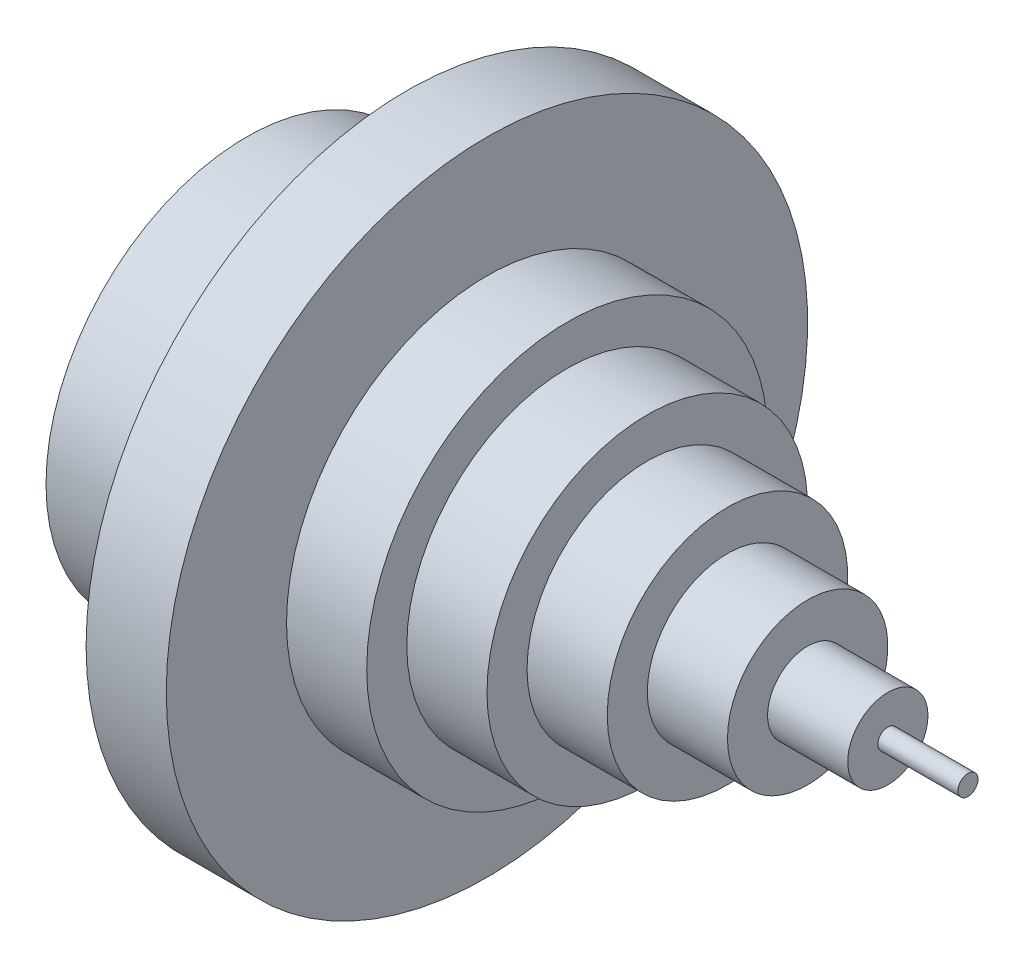
ISO-10303-21;
HEADER;
FILE_DESCRIPTION(('STEP AP214'),'2;1');
FILE_NAME('part.step','',(''),(''),'','','');
FILE_SCHEMA(('AUTOMOTIVE_DESIGN { 1 0 10303 214 1 1 1 1 }'));
ENDSEC;
DATA;
#1=APPLICATION_CONTEXT('core data for automotive mechanical design processes');
#2=APPLICATION_PROTOCOL_DEFINITION('international standard','automotive_design',2000,#1);
#3=PRODUCT_CONTEXT('',#1,'mechanical');
#4=PRODUCT('Part','Part','',(#3));
#5=PRODUCT_RELATED_PRODUCT_CATEGORY('part','',(#4));
#6=PRODUCT_DEFINITION_FORMATION('','',#4);
#7=PRODUCT_DEFINITION_CONTEXT('part definition',#1,'design');
#8=PRODUCT_DEFINITION('design','',#6,#7);
#9=PRODUCT_DEFINITION_SHAPE('','',#8);
#10=(LENGTH_UNIT() NAMED_UNIT(*) SI_UNIT(.MILLI.,.METRE.));
#11=(NAMED_UNIT(*) PLANE_ANGLE_UNIT() SI_UNIT($,.RADIAN.));
#12=(NAMED_UNIT(*) SI_UNIT($,.STERADIAN.) SOLID_ANGLE_UNIT());
#13=UNCERTAINTY_MEASURE_WITH_UNIT(LENGTH_MEASURE(1.E-05),#10,'distance_accuracy_value','');
#14=(GEOMETRIC_REPRESENTATION_CONTEXT(3) GLOBAL_UNCERTAINTY_ASSIGNED_CONTEXT((#13)) GLOBAL_UNIT_ASSIGNED_CONTEXT((#10,
#11,#12)) REPRESENTATION_CONTEXT('',''));
#15=CARTESIAN_POINT('',(0.,0.,0.));
#16=DIRECTION('',(0.,0.,1.));
#17=DIRECTION('',(1.,0.,0.));
#18=AXIS2_PLACEMENT_3D('',#15,#16,#17);
#19=CARTESIAN_POINT('',(-106.966820462199,0.,0.));
#20=DIRECTION('',(-1.,0.,0.));
#21=DIRECTION('',(0.,0.,1.));
#22=AXIS2_PLACEMENT_3D('',#19,#20,#21);
#23=CYLINDRICAL_SURFACE('',#22,80.);
#24=CARTESIAN_POINT('',(40.,0.,0.));
#25=DIRECTION('',(-1.,0.,0.));
#26=DIRECTION('',(0.,0.,1.));
#27=AXIS2_PLACEMENT_3D('',#24,#25,#26);
#28=CIRCLE('',#27,80.);
#29=CARTESIAN_POINT('',(40.,0.,80.));
#30=VERTEX_POINT('',#29);
#31=EDGE_CURVE('E83',#30,#30,#28,.T.);
#32=ORIENTED_EDGE('',*,*,#31,.F.);
#33=EDGE_LOOP('',(#32));
#34=FACE_BOUND('',#33,.T.);
#35=CARTESIAN_POINT('',(60.,0.,0.));
#36=DIRECTION('',(-1.,0.,0.));
#37=DIRECTION('',(0.,0.,1.));
#38=AXIS2_PLACEMENT_3D('',#35,#36,#37);
#39=CIRCLE('',#38,80.);
#40=CARTESIAN_POINT('',(60.,0.,80.));
#41=VERTEX_POINT('',#40);
#42=EDGE_CURVE('E10',#41,#41,#39,.T.);
#43=ORIENTED_EDGE('',*,*,#42,.T.);
#44=EDGE_LOOP('',(#43));
#45=FACE_BOUND('',#44,.T.);
#46=ADVANCED_FACE('F31',(#34,#45),#23,.T.);
#47=CARTESIAN_POINT('',(60.,80.,0.));
#48=DIRECTION('',(-1.,0.,0.));
#49=DIRECTION('',(0.,0.,1.));
#50=AXIS2_PLACEMENT_3D('',#47,#48,#49);
#51=PLANE('',#50);
#52=ORIENTED_EDGE('',*,*,#42,.F.);
#53=EDGE_LOOP('',(#52));
#54=FACE_BOUND('',#53,.T.);
#55=CARTESIAN_POINT('',(60.,0.,0.));
#56=DIRECTION('',(-1.,0.,0.));
#57=DIRECTION('',(0.,0.,1.));
#58=AXIS2_PLACEMENT_3D('',#55,#56,#57);
#59=CIRCLE('',#58,50.);
#60=CARTESIAN_POINT('',(60.,0.,50.));
#61=VERTEX_POINT('',#60);
#62=EDGE_CURVE('E37',#61,#61,#59,.T.);
#63=ORIENTED_EDGE('',*,*,#62,.T.);
#64=EDGE_LOOP('',(#63));
#65=FACE_BOUND('',#64,.T.);
#66=ADVANCED_FACE('F121',(#54,#65),#51,.F.);
#67=CARTESIAN_POINT('',(-106.966820462199,0.,0.));
#68=DIRECTION('',(-1.,0.,0.));
#69=DIRECTION('',(0.,0.,1.));
#70=AXIS2_PLACEMENT_3D('',#67,#68,#69);
#71=CYLINDRICAL_SURFACE('',#70,50.);
#72=ORIENTED_EDGE('',*,*,#62,.F.);
#73=EDGE_LOOP('',(#72));
#74=FACE_BOUND('',#73,.T.);
#75=CARTESIAN_POINT('',(80.,0.,0.));
#76=DIRECTION('',(-1.,0.,0.));
#77=DIRECTION('',(0.,0.,1.));
#78=AXIS2_PLACEMENT_3D('',#75,#76,#77);
#79=CIRCLE('',#78,50.);
#80=CARTESIAN_POINT('',(80.,0.,50.));
#81=VERTEX_POINT('',#80);
#82=EDGE_CURVE('E41',#81,#81,#79,.T.);
#83=ORIENTED_EDGE('',*,*,#82,.T.);
#84=EDGE_LOOP('',(#83));
#85=FACE_BOUND('',#84,.T.);
#86=ADVANCED_FACE('F125',(#74,#85),#71,.T.);
#87=CARTESIAN_POINT('',(80.,50.,0.));
#88=DIRECTION('',(-1.,0.,0.));
#89=DIRECTION('',(0.,0.,1.));
#90=AXIS2_PLACEMENT_3D('',#87,#88,#89);
#91=PLANE('',#90);
#92=ORIENTED_EDGE('',*,*,#82,.F.);
#93=EDGE_LOOP('',(#92));
#94=FACE_BOUND('',#93,.T.);
#95=CARTESIAN_POINT('',(80.,0.,0.));
#96=DIRECTION('',(-1.,0.,0.));
#97=DIRECTION('',(0.,0.,1.));
#98=AXIS2_PLACEMENT_3D('',#95,#96,#97);
#99=CIRCLE('',#98,40.);
#100=CARTESIAN_POINT('',(80.,0.,40.));
#101=VERTEX_POINT('',#100);
#102=EDGE_CURVE('E45',#101,#101,#99,.T.);
#103=ORIENTED_EDGE('',*,*,#102,.T.);
#104=EDGE_LOOP('',(#103));
#105=FACE_BOUND('',#104,.T.);
#106=ADVANCED_FACE('F130',(#94,#105),#91,.F.);
#107=CARTESIAN_POINT('',(-106.966820462199,0.,0.));
#108=DIRECTION('',(-1.,0.,0.));
#109=DIRECTION('',(0.,0.,1.));
#110=AXIS2_PLACEMENT_3D('',#107,#108,#109);
#111=CYLINDRICAL_SURFACE('',#110,40.);
#112=ORIENTED_EDGE('',*,*,#102,.F.);
#113=EDGE_LOOP('',(#112));
#114=FACE_BOUND('',#113,.T.);
#115=CARTESIAN_POINT('',(100.,0.,0.));
#116=DIRECTION('',(-1.,0.,0.));
#117=DIRECTION('',(0.,0.,1.));
#118=AXIS2_PLACEMENT_3D('',#115,#116,#117);
#119=CIRCLE('',#118,40.);
#120=CARTESIAN_POINT('',(100.,0.,40.));
#121=VERTEX_POINT('',#120);
#122=EDGE_CURVE('E50',#121,#121,#119,.T.);
#123=ORIENTED_EDGE('',*,*,#122,.T.);
#124=EDGE_LOOP('',(#123));
#125=FACE_BOUND('',#124,.T.);
#126=ADVANCED_FACE('F136',(#114,#125),#111,.T.);
#127=CARTESIAN_POINT('',(100.,40.,0.));
#128=DIRECTION('',(-1.,0.,0.));
#129=DIRECTION('',(0.,0.,1.));
#130=AXIS2_PLACEMENT_3D('',#127,#128,#129);
#131=PLANE('',#130);
#132=ORIENTED_EDGE('',*,*,#122,.F.);
#133=EDGE_LOOP('',(#132));
#134=FACE_BOUND('',#133,.T.);
#135=CARTESIAN_POINT('',(100.,0.,0.));
#136=DIRECTION('',(-1.,0.,0.));
#137=DIRECTION('',(0.,0.,1.));
#138=AXIS2_PLACEMENT_3D('',#135,#136,#137);
#139=CIRCLE('',#138,30.);
#140=CARTESIAN_POINT('',(100.,0.,30.));
#141=VERTEX_POINT('',#140);
#142=EDGE_CURVE('E53',#141,#141,#139,.T.);
#143=ORIENTED_EDGE('',*,*,#142,.T.);
#144=EDGE_LOOP('',(#143));
#145=FACE_BOUND('',#144,.T.);
#146=ADVANCED_FACE('F140',(#134,#145),#131,.F.);
#147=CARTESIAN_POINT('',(-106.966820462199,0.,0.));
#148=DIRECTION('',(-1.,0.,0.));
#149=DIRECTION('',(0.,0.,1.));
#150=AXIS2_PLACEMENT_3D('',#147,#148,#149);
#151=CYLINDRICAL_SURFACE('',#150,30.);
#152=ORIENTED_EDGE('',*,*,#142,.F.);
#153=EDGE_LOOP('',(#152));
#154=FACE_BOUND('',#153,.T.);
#155=CARTESIAN_POINT('',(120.,0.,0.));
#156=DIRECTION('',(-1.,0.,0.));
#157=DIRECTION('',(0.,0.,1.));
#158=AXIS2_PLACEMENT_3D('',#155,#156,#157);
#159=CIRCLE('',#158,30.);
#160=CARTESIAN_POINT('',(120.,0.,30.));
#161=VERTEX_POINT('',#160);
#162=EDGE_CURVE('E56',#161,#161,#159,.T.);
#163=ORIENTED_EDGE('',*,*,#162,.T.);
#164=EDGE_LOOP('',(#163));
#165=FACE_BOUND('',#164,.T.);
#166=ADVANCED_FACE('F144',(#154,#165),#151,.T.);
#167=CARTESIAN_POINT('',(120.,30.,0.));
#168=DIRECTION('',(-1.,0.,0.));
#169=DIRECTION('',(0.,0.,1.));
#170=AXIS2_PLACEMENT_3D('',#167,#168,#169);
#171=PLANE('',#170);
#172=ORIENTED_EDGE('',*,*,#162,.F.);
#173=EDGE_LOOP('',(#172));
#174=FACE_BOUND('',#173,.T.);
#175=CARTESIAN_POINT('',(120.,0.,0.));
#176=DIRECTION('',(-1.,0.,0.));
#177=DIRECTION('',(0.,0.,1.));
#178=AXIS2_PLACEMENT_3D('',#175,#176,#177);
#179=CIRCLE('',#178,20.);
#180=CARTESIAN_POINT('',(120.,0.,20.));
#181=VERTEX_POINT('',#180);
#182=EDGE_CURVE('E59',#181,#181,#179,.T.);
#183=ORIENTED_EDGE('',*,*,#182,.T.);
#184=EDGE_LOOP('',(#183));
#185=FACE_BOUND('',#184,.T.);
#186=ADVANCED_FACE('F148',(#174,#185),#171,.F.);
#187=CARTESIAN_POINT('',(-106.966820462199,0.,0.));
#188=DIRECTION('',(-1.,0.,0.));
#189=DIRECTION('',(0.,0.,1.));
#190=AXIS2_PLACEMENT_3D('',#187,#188,#189);
#191=CYLINDRICAL_SURFACE('',#190,20.);
#192=ORIENTED_EDGE('',*,*,#182,.F.);
#193=EDGE_LOOP('',(#192));
#194=FACE_BOUND('',#193,.T.);
#195=CARTESIAN_POINT('',(140.,0.,0.));
#196=DIRECTION('',(-1.,0.,0.));
#197=DIRECTION('',(0.,0.,1.));
#198=AXIS2_PLACEMENT_3D('',#195,#196,#197);
#199=CIRCLE('',#198,20.);
#200=CARTESIAN_POINT('',(140.,0.,20.));
#201=VERTEX_POINT('',#200);
#202=EDGE_CURVE('E62',#201,#201,#199,.T.);
#203=ORIENTED_EDGE('',*,*,#202,.T.);
#204=EDGE_LOOP('',(#203));
#205=FACE_BOUND('',#204,.T.);
#206=ADVANCED_FACE('F152',(#194,#205),#191,.T.);
#207=CARTESIAN_POINT('',(140.,20.,0.));
#208=DIRECTION('',(-1.,0.,0.));
#209=DIRECTION('',(0.,0.,1.));
#210=AXIS2_PLACEMENT_3D('',#207,#208,#209);
#211=PLANE('',#210);
#212=ORIENTED_EDGE('',*,*,#202,.F.);
#213=EDGE_LOOP('',(#212));
#214=FACE_BOUND('',#213,.T.);
#215=CARTESIAN_POINT('',(140.,0.,0.));
#216=DIRECTION('',(-1.,0.,0.));
#217=DIRECTION('',(0.,0.,1.));
#218=AXIS2_PLACEMENT_3D('',#215,#216,#217);
#219=CIRCLE('',#218,10.);
#220=CARTESIAN_POINT('',(140.,0.,10.));
#221=VERTEX_POINT('',#220);
#222=EDGE_CURVE('E65',#221,#221,#219,.T.);
#223=ORIENTED_EDGE('',*,*,#222,.T.);
#224=EDGE_LOOP('',(#223));
#225=FACE_BOUND('',#224,.T.);
#226=ADVANCED_FACE('F156',(#214,#225),#211,.F.);
#227=CARTESIAN_POINT('',(-106.966820462199,0.,0.));
#228=DIRECTION('',(-1.,0.,0.));
#229=DIRECTION('',(0.,0.,1.));
#230=AXIS2_PLACEMENT_3D('',#227,#228,#229);
#231=CYLINDRICAL_SURFACE('',#230,10.);
#232=ORIENTED_EDGE('',*,*,#222,.F.);
#233=EDGE_LOOP('',(#232));
#234=FACE_BOUND('',#233,.T.);
#235=CARTESIAN_POINT('',(160.,0.,0.));
#236=DIRECTION('',(-1.,0.,0.));
#237=DIRECTION('',(0.,0.,1.));
#238=AXIS2_PLACEMENT_3D('',#235,#236,#237);
#239=CIRCLE('',#238,10.);
#240=CARTESIAN_POINT('',(160.,0.,10.));
#241=VERTEX_POINT('',#240);
#242=EDGE_CURVE('E68',#241,#241,#239,.T.);
#243=ORIENTED_EDGE('',*,*,#242,.T.);
#244=EDGE_LOOP('',(#243));
#245=FACE_BOUND('',#244,.T.);
#246=ADVANCED_FACE('F160',(#234,#245),#231,.T.);
#247=CARTESIAN_POINT('',(160.,10.,0.));
#248=DIRECTION('',(-1.,0.,0.));
#249=DIRECTION('',(0.,0.,1.));
#250=AXIS2_PLACEMENT_3D('',#247,#248,#249);
#251=PLANE('',#250);
#252=ORIENTED_EDGE('',*,*,#242,.F.);
#253=EDGE_LOOP('',(#252));
#254=FACE_BOUND('',#253,.T.);
#255=CARTESIAN_POINT('',(160.,0.,0.));
#256=DIRECTION('',(-1.,0.,0.));
#257=DIRECTION('',(0.,0.,1.));
#258=AXIS2_PLACEMENT_3D('',#255,#256,#257);
#259=CIRCLE('',#258,2.5);
#260=CARTESIAN_POINT('',(160.,0.,2.5));
#261=VERTEX_POINT('',#260);
#262=EDGE_CURVE('E71',#261,#261,#259,.T.);
#263=ORIENTED_EDGE('',*,*,#262,.T.);
#264=EDGE_LOOP('',(#263));
#265=FACE_BOUND('',#264,.T.);
#266=ADVANCED_FACE('F164',(#254,#265),#251,.F.);
#267=CARTESIAN_POINT('',(-106.966820462199,0.,0.));
#268=DIRECTION('',(-1.,0.,0.));
#269=DIRECTION('',(0.,0.,1.));
#270=AXIS2_PLACEMENT_3D('',#267,#268,#269);
#271=CYLINDRICAL_SURFACE('',#270,2.5);
#272=ORIENTED_EDGE('',*,*,#262,.F.);
#273=EDGE_LOOP('',(#272));
#274=FACE_BOUND('',#273,.T.);
#275=CARTESIAN_POINT('',(180.,0.,0.));
#276=DIRECTION('',(-1.,0.,0.));
#277=DIRECTION('',(0.,0.,1.));
#278=AXIS2_PLACEMENT_3D('',#275,#276,#277);
#279=CIRCLE('',#278,2.5);
#280=CARTESIAN_POINT('',(180.,0.,2.5));
#281=VERTEX_POINT('',#280);
#282=EDGE_CURVE('E74',#281,#281,#279,.T.);
#283=ORIENTED_EDGE('',*,*,#282,.T.);
#284=EDGE_LOOP('',(#283));
#285=FACE_BOUND('',#284,.T.);
#286=ADVANCED_FACE('F168',(#274,#285),#271,.T.);
#287=CARTESIAN_POINT('',(180.,2.5,0.));
#288=DIRECTION('',(-1.,0.,0.));
#289=DIRECTION('',(0.,0.,1.));
#290=AXIS2_PLACEMENT_3D('',#287,#288,#289);
#291=PLANE('',#290);
#292=ORIENTED_EDGE('',*,*,#282,.F.);
#293=EDGE_LOOP('',(#292));
#294=FACE_BOUND('',#293,.T.);
#295=ADVANCED_FACE('F106',(#294),#291,.F.);
#296=CARTESIAN_POINT('',(0.,50.,0.));
#297=DIRECTION('',(1.,0.,0.));
#298=DIRECTION('',(0.,0.,-1.));
#299=AXIS2_PLACEMENT_3D('',#296,#297,#298);
#300=PLANE('',#299);
#301=CARTESIAN_POINT('',(0.,0.,0.));
#302=DIRECTION('',(-1.,0.,0.));
#303=DIRECTION('',(0.,0.,1.));
#304=AXIS2_PLACEMENT_3D('',#301,#302,#303);
#305=CIRCLE('',#304,40.);
#306=CARTESIAN_POINT('',(0.,0.,40.));
#307=VERTEX_POINT('',#306);
#308=EDGE_CURVE('E87',#307,#307,#305,.T.);
#309=ORIENTED_EDGE('',*,*,#308,.F.);
#310=EDGE_LOOP('',(#309));
#311=FACE_BOUND('',#310,.T.);
#312=CARTESIAN_POINT('',(0.,0.,0.));
#313=DIRECTION('',(-1.,0.,0.));
#314=DIRECTION('',(0.,0.,1.));
#315=AXIS2_PLACEMENT_3D('',#312,#313,#314);
#316=CIRCLE('',#315,50.);
#317=CARTESIAN_POINT('',(0.,0.,50.));
#318=VERTEX_POINT('',#317);
#319=EDGE_CURVE('E77',#318,#318,#316,.T.);
#320=ORIENTED_EDGE('',*,*,#319,.T.);
#321=EDGE_LOOP('',(#320));
#322=FACE_BOUND('',#321,.T.);
#323=ADVANCED_FACE('F102',(#311,#322),#300,.F.);
#324=CARTESIAN_POINT('',(-106.966820462199,0.,0.));
#325=DIRECTION('',(-1.,0.,0.));
#326=DIRECTION('',(0.,0.,1.));
#327=AXIS2_PLACEMENT_3D('',#324,#325,#326);
#328=CYLINDRICAL_SURFACE('',#327,50.);
#329=ORIENTED_EDGE('',*,*,#319,.F.);
#330=EDGE_LOOP('',(#329));
#331=FACE_BOUND('',#330,.T.);
#332=CARTESIAN_POINT('',(40.,0.,0.));
#333=DIRECTION('',(-1.,0.,0.));
#334=DIRECTION('',(0.,0.,1.));
#335=AXIS2_PLACEMENT_3D('',#332,#333,#334);
#336=CIRCLE('',#335,50.);
#337=CARTESIAN_POINT('',(40.,0.,50.));
#338=VERTEX_POINT('',#337);
#339=EDGE_CURVE('E80',#338,#338,#336,.T.);
#340=ORIENTED_EDGE('',*,*,#339,.T.);
#341=EDGE_LOOP('',(#340));
#342=FACE_BOUND('',#341,.T.);
#343=ADVANCED_FACE('F105',(#331,#342),#328,.T.);
#344=CARTESIAN_POINT('',(40.,50.,0.));
#345=DIRECTION('',(1.,0.,0.));
#346=DIRECTION('',(0.,0.,-1.));
#347=AXIS2_PLACEMENT_3D('',#344,#345,#346);
#348=PLANE('',#347);
#349=ORIENTED_EDGE('',*,*,#339,.F.);
#350=EDGE_LOOP('',(#349));
#351=FACE_BOUND('',#350,.T.);
#352=ORIENTED_EDGE('',*,*,#31,.T.);
#353=EDGE_LOOP('',(#352));
#354=FACE_BOUND('',#353,.T.);
#355=ADVANCED_FACE('F98',(#351,#354),#348,.F.);
#356=CARTESIAN_POINT('',(40.,0.,0.));
#357=DIRECTION('',(-1.,0.,0.));
#358=DIRECTION('',(0.,0.,1.));
#359=AXIS2_PLACEMENT_3D('',#356,#357,#358);
#360=CYLINDRICAL_SURFACE('',#359,40.);
#361=CARTESIAN_POINT('',(40.,0.,0.));
#362=DIRECTION('',(-1.,0.,0.));
#363=DIRECTION('',(0.,0.,1.));
#364=AXIS2_PLACEMENT_3D('',#361,#362,#363);
#365=CIRCLE('',#364,40.);
#366=CARTESIAN_POINT('',(40.,0.,40.));
#367=VERTEX_POINT('',#366);
#368=EDGE_CURVE('E86',#367,#367,#365,.T.);
#369=ORIENTED_EDGE('',*,*,#368,.F.);
#370=EDGE_LOOP('',(#369));
#371=FACE_BOUND('',#370,.T.);
#372=ORIENTED_EDGE('',*,*,#308,.T.);
#373=EDGE_LOOP('',(#372));
#374=FACE_BOUND('',#373,.T.);
#375=ADVANCED_FACE('F95',(#371,#374),#360,.F.);
#376=CARTESIAN_POINT('',(40.,0.,0.));
#377=DIRECTION('',(-1.,0.,0.));
#378=DIRECTION('',(0.,0.,1.));
#379=AXIS2_PLACEMENT_3D('',#376,#377,#378);
#380=PLANE('',#379);
#381=ORIENTED_EDGE('',*,*,#368,.T.);
#382=EDGE_LOOP('',(#381));
#383=FACE_BOUND('',#382,.T.);
#384=ADVANCED_FACE('F93',(#383),#380,.T.);
#385=CLOSED_SHELL('',(#46,#66,#86,#106,#126,#146,#166,#186,#206,#226,#246,#266,#286,#295,#323,
#343,#355,#375,#384));
#386=MANIFOLD_SOLID_BREP('B2',#385);
#387=ADVANCED_BREP_SHAPE_REPRESENTATION('',(#18,#386),#14);
#388=SHAPE_DEFINITION_REPRESENTATION(#9,#387);
ENDSEC;
END-ISO-10303-21;
